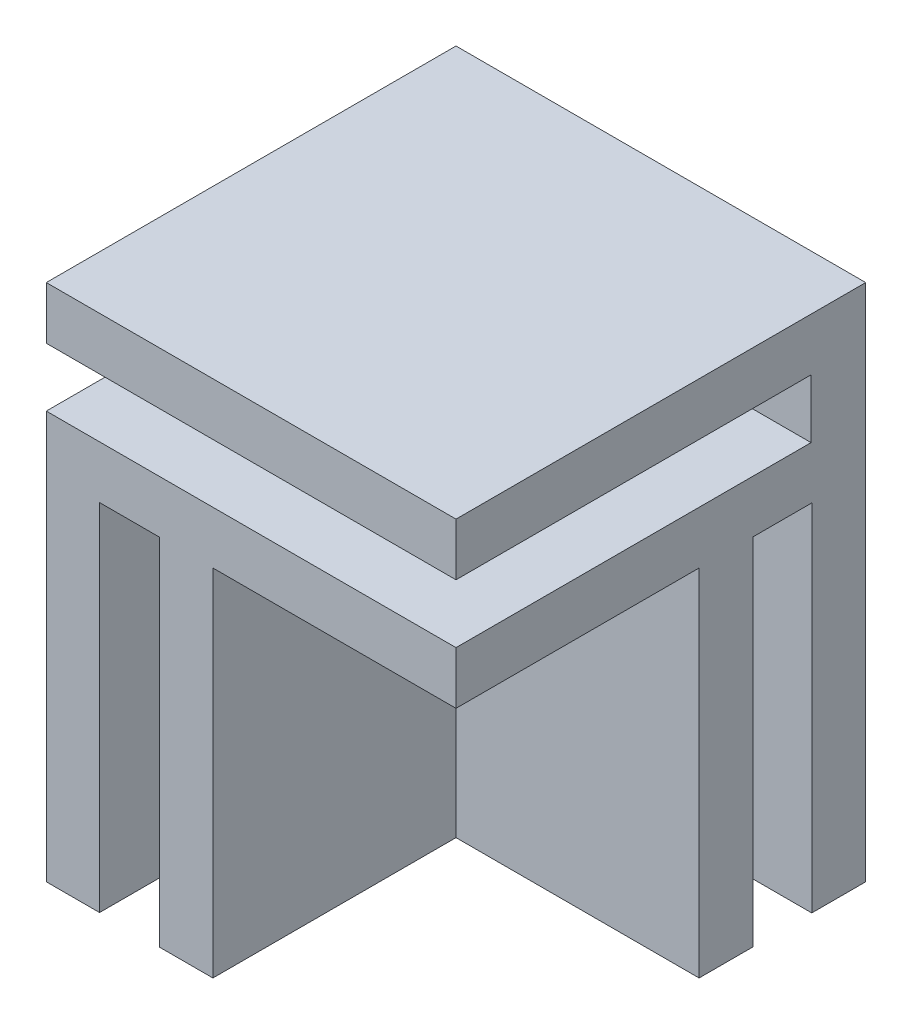
ISO-10303-21;
HEADER;
FILE_DESCRIPTION(('STEP AP214'),'2;1');
FILE_NAME('part.step','',(''),(''),'','','');
FILE_SCHEMA(('AUTOMOTIVE_DESIGN { 1 0 10303 214 1 1 1 1 }'));
ENDSEC;
DATA;
#1=APPLICATION_CONTEXT('core data for automotive mechanical design processes');
#2=APPLICATION_PROTOCOL_DEFINITION('international standard','automotive_design',2000,#1);
#3=PRODUCT_CONTEXT('',#1,'mechanical');
#4=PRODUCT('Part','Part','',(#3));
#5=PRODUCT_RELATED_PRODUCT_CATEGORY('part','',(#4));
#6=PRODUCT_DEFINITION_FORMATION('','',#4);
#7=PRODUCT_DEFINITION_CONTEXT('part definition',#1,'design');
#8=PRODUCT_DEFINITION('design','',#6,#7);
#9=PRODUCT_DEFINITION_SHAPE('','',#8);
#10=(LENGTH_UNIT() NAMED_UNIT(*) SI_UNIT(.MILLI.,.METRE.));
#11=(NAMED_UNIT(*) PLANE_ANGLE_UNIT() SI_UNIT($,.RADIAN.));
#12=(NAMED_UNIT(*) SI_UNIT($,.STERADIAN.) SOLID_ANGLE_UNIT());
#13=UNCERTAINTY_MEASURE_WITH_UNIT(LENGTH_MEASURE(1.E-05),#10,'distance_accuracy_value','');
#14=(GEOMETRIC_REPRESENTATION_CONTEXT(3) GLOBAL_UNCERTAINTY_ASSIGNED_CONTEXT((#13)) GLOBAL_UNIT_ASSIGNED_CONTEXT((#10,
#11,#12)) REPRESENTATION_CONTEXT('',''));
#15=CARTESIAN_POINT('',(0.,0.,0.));
#16=DIRECTION('',(0.,0.,1.));
#17=DIRECTION('',(1.,0.,0.));
#18=AXIS2_PLACEMENT_3D('',#15,#16,#17);
#19=CARTESIAN_POINT('',(-35.886738322403,38.,16.4685314685316));
#20=DIRECTION('',(0.,0.,-1.));
#21=DIRECTION('',(-1.,0.,0.));
#22=AXIS2_PLACEMENT_3D('',#19,#20,#21);
#23=PLANE('',#22);
#24=DIRECTION('',(0.,-1.,0.));
#25=VECTOR('',#24,1.);
#26=CARTESIAN_POINT('',(-5.88673832240304,38.,16.4685314685316));
#27=LINE('',#26,#25);
#28=CARTESIAN_POINT('',(-5.88673832240304,29.85,16.4685314685316));
#29=VERTEX_POINT('',#28);
#30=CARTESIAN_POINT('',(-5.88673832240304,26.,16.4685314685316));
#31=VERTEX_POINT('',#30);
#32=EDGE_CURVE('E196',#29,#31,#27,.T.);
#33=ORIENTED_EDGE('',*,*,#32,.F.);
#34=DIRECTION('',(-1.,0.,0.));
#35=VECTOR('',#34,1.);
#36=CARTESIAN_POINT('',(-5.88673832240304,29.85,16.4685314685316));
#37=LINE('',#36,#35);
#38=CARTESIAN_POINT('',(-35.886738322403,29.85,16.4685314685316));
#39=VERTEX_POINT('',#38);
#40=EDGE_CURVE('E255',#29,#39,#37,.T.);
#41=ORIENTED_EDGE('',*,*,#40,.T.);
#42=DIRECTION('',(0.,-1.,0.));
#43=VECTOR('',#42,1.);
#44=CARTESIAN_POINT('',(-35.886738322403,38.,16.4685314685316));
#45=LINE('',#44,#43);
#46=CARTESIAN_POINT('',(-35.886738322403,0.,16.4685314685316));
#47=VERTEX_POINT('',#46);
#48=EDGE_CURVE('E48',#39,#47,#45,.T.);
#49=ORIENTED_EDGE('',*,*,#48,.T.);
#50=DIRECTION('',(1.,0.,0.));
#51=VECTOR('',#50,1.);
#52=CARTESIAN_POINT('',(-35.886738322403,0.,16.4685314685316));
#53=LINE('',#52,#51);
#54=CARTESIAN_POINT('',(-31.986738322403,0.,16.4685314685316));
#55=VERTEX_POINT('',#54);
#56=EDGE_CURVE('E217',#47,#55,#53,.T.);
#57=ORIENTED_EDGE('',*,*,#56,.T.);
#58=DIRECTION('',(0.,-1.,0.));
#59=VECTOR('',#58,1.);
#60=CARTESIAN_POINT('',(-31.986738322403,26.,16.4685314685316));
#61=LINE('',#60,#59);
#62=CARTESIAN_POINT('',(-31.986738322403,26.,16.4685314685316));
#63=VERTEX_POINT('',#62);
#64=EDGE_CURVE('E274',#63,#55,#61,.T.);
#65=ORIENTED_EDGE('',*,*,#64,.F.);
#66=DIRECTION('',(-1.,0.,0.));
#67=VECTOR('',#66,1.);
#68=CARTESIAN_POINT('',(-27.586738322403,26.,16.4685314685316));
#69=LINE('',#68,#67);
#70=CARTESIAN_POINT('',(-27.586738322403,26.,16.4685314685316));
#71=VERTEX_POINT('',#70);
#72=EDGE_CURVE('E303',#71,#63,#69,.T.);
#73=ORIENTED_EDGE('',*,*,#72,.F.);
#74=DIRECTION('',(0.,-1.,0.));
#75=VECTOR('',#74,1.);
#76=CARTESIAN_POINT('',(-27.586738322403,26.,16.4685314685316));
#77=LINE('',#76,#75);
#78=CARTESIAN_POINT('',(-27.586738322403,0.,16.4685314685316));
#79=VERTEX_POINT('',#78);
#80=EDGE_CURVE('E270',#71,#79,#77,.T.);
#81=ORIENTED_EDGE('',*,*,#80,.T.);
#82=CARTESIAN_POINT('',(-23.686738322403,0.,16.4685314685316));
#83=VERTEX_POINT('',#82);
#84=EDGE_CURVE('E221',#79,#83,#53,.T.);
#85=ORIENTED_EDGE('',*,*,#84,.T.);
#86=DIRECTION('',(0.,-1.,0.));
#87=VECTOR('',#86,1.);
#88=CARTESIAN_POINT('',(-23.686738322403,26.,16.4685314685316));
#89=LINE('',#88,#87);
#90=CARTESIAN_POINT('',(-23.686738322403,26.,16.4685314685316));
#91=VERTEX_POINT('',#90);
#92=EDGE_CURVE('E63',#91,#83,#89,.T.);
#93=ORIENTED_EDGE('',*,*,#92,.F.);
#94=DIRECTION('',(-1.,0.,0.));
#95=VECTOR('',#94,1.);
#96=CARTESIAN_POINT('',(-5.88673832240304,26.,16.4685314685316));
#97=LINE('',#96,#95);
#98=EDGE_CURVE('E263',#31,#91,#97,.T.);
#99=ORIENTED_EDGE('',*,*,#98,.F.);
#100=EDGE_LOOP('',(#33,#41,#49,#57,#65,#73,#81,#85,#93,#99));
#101=FACE_BOUND('',#100,.T.);
#102=ADVANCED_FACE('F39',(#101),#23,.F.);
#103=CARTESIAN_POINT('',(-35.886738322403,38.,-13.5314685314684));
#104=DIRECTION('',(1.,0.,0.));
#105=DIRECTION('',(0.,0.,-1.));
#106=AXIS2_PLACEMENT_3D('',#103,#104,#105);
#107=PLANE('',#106);
#108=ORIENTED_EDGE('',*,*,#48,.F.);
#109=DIRECTION('',(0.,0.,1.));
#110=VECTOR('',#109,1.);
#111=CARTESIAN_POINT('',(-35.886738322403,29.85,16.4685314685316));
#112=LINE('',#111,#110);
#113=CARTESIAN_POINT('',(-35.886738322403,29.85,-9.53146853146841));
#114=VERTEX_POINT('',#113);
#115=EDGE_CURVE('E181',#114,#39,#112,.T.);
#116=ORIENTED_EDGE('',*,*,#115,.F.);
#117=DIRECTION('',(0.,-1.,0.));
#118=VECTOR('',#117,1.);
#119=CARTESIAN_POINT('',(-35.886738322403,34.15,-9.53146853146841));
#120=LINE('',#119,#118);
#121=CARTESIAN_POINT('',(-35.886738322403,34.15,-9.53146853146841));
#122=VERTEX_POINT('',#121);
#123=EDGE_CURVE('E358',#122,#114,#120,.T.);
#124=ORIENTED_EDGE('',*,*,#123,.F.);
#125=DIRECTION('',(0.,0.,-1.));
#126=VECTOR('',#125,1.);
#127=CARTESIAN_POINT('',(-35.886738322403,34.15,16.4685314685316));
#128=LINE('',#127,#126);
#129=CARTESIAN_POINT('',(-35.886738322403,34.15,16.4685314685316));
#130=VERTEX_POINT('',#129);
#131=EDGE_CURVE('E362',#130,#122,#128,.T.);
#132=ORIENTED_EDGE('',*,*,#131,.F.);
#133=CARTESIAN_POINT('',(-35.886738322403,38.,16.4685314685316));
#134=VERTEX_POINT('',#133);
#135=EDGE_CURVE('E11',#134,#130,#45,.T.);
#136=ORIENTED_EDGE('',*,*,#135,.F.);
#137=DIRECTION('',(0.,0.,1.));
#138=VECTOR('',#137,1.);
#139=CARTESIAN_POINT('',(-35.886738322403,38.,-13.5314685314684));
#140=LINE('',#139,#138);
#141=CARTESIAN_POINT('',(-35.886738322403,38.,-13.5314685314684));
#142=VERTEX_POINT('',#141);
#143=EDGE_CURVE('E212',#142,#134,#140,.T.);
#144=ORIENTED_EDGE('',*,*,#143,.F.);
#145=DIRECTION('',(0.,-1.,0.));
#146=VECTOR('',#145,1.);
#147=CARTESIAN_POINT('',(-35.886738322403,38.,-13.5314685314684));
#148=LINE('',#147,#146);
#149=CARTESIAN_POINT('',(-35.886738322403,0.,-13.5314685314684));
#150=VERTEX_POINT('',#149);
#151=EDGE_CURVE('E204',#142,#150,#148,.T.);
#152=ORIENTED_EDGE('',*,*,#151,.T.);
#153=DIRECTION('',(0.,0.,1.));
#154=VECTOR('',#153,1.);
#155=CARTESIAN_POINT('',(-35.886738322403,0.,-13.5314685314684));
#156=LINE('',#155,#154);
#157=EDGE_CURVE('E222',#150,#47,#156,.T.);
#158=ORIENTED_EDGE('',*,*,#157,.T.);
#159=EDGE_LOOP('',(#108,#116,#124,#132,#136,#144,#152,#158));
#160=FACE_BOUND('',#159,.T.);
#161=ADVANCED_FACE('F41',(#160),#107,.F.);
#162=ORIENTED_EDGE('',*,*,#135,.T.);
#163=DIRECTION('',(-1.,0.,0.));
#164=VECTOR('',#163,1.);
#165=CARTESIAN_POINT('',(-5.88673832240304,34.15,16.4685314685316));
#166=LINE('',#165,#164);
#167=CARTESIAN_POINT('',(-5.88673832240304,34.15,16.4685314685316));
#168=VERTEX_POINT('',#167);
#169=EDGE_CURVE('E175',#168,#130,#166,.T.);
#170=ORIENTED_EDGE('',*,*,#169,.F.);
#171=CARTESIAN_POINT('',(-5.88673832240304,38.,16.4685314685316));
#172=VERTEX_POINT('',#171);
#173=EDGE_CURVE('E186',#172,#168,#27,.T.);
#174=ORIENTED_EDGE('',*,*,#173,.F.);
#175=DIRECTION('',(1.,0.,0.));
#176=VECTOR('',#175,1.);
#177=CARTESIAN_POINT('',(-35.886738322403,38.,16.4685314685316));
#178=LINE('',#177,#176);
#179=EDGE_CURVE('E231',#134,#172,#178,.T.);
#180=ORIENTED_EDGE('',*,*,#179,.F.);
#181=EDGE_LOOP('',(#162,#170,#174,#180));
#182=FACE_BOUND('',#181,.T.);
#183=ADVANCED_FACE('F185',(#182),#23,.F.);
#184=CARTESIAN_POINT('',(-5.88673832240304,38.,-13.5314685314684));
#185=DIRECTION('',(-1.,0.,0.));
#186=DIRECTION('',(0.,0.,1.));
#187=AXIS2_PLACEMENT_3D('',#184,#185,#186);
#188=PLANE('',#187);
#189=DIRECTION('',(0.,-1.,0.));
#190=VECTOR('',#189,1.);
#191=CARTESIAN_POINT('',(-5.88673832240304,34.15,-9.53146853146841));
#192=LINE('',#191,#190);
#193=CARTESIAN_POINT('',(-5.88673832240304,34.15,-9.53146853146841));
#194=VERTEX_POINT('',#193);
#195=CARTESIAN_POINT('',(-5.88673832240304,29.85,-9.53146853146841));
#196=VERTEX_POINT('',#195);
#197=EDGE_CURVE('E55',#194,#196,#192,.T.);
#198=ORIENTED_EDGE('',*,*,#197,.T.);
#199=DIRECTION('',(0.,0.,1.));
#200=VECTOR('',#199,1.);
#201=CARTESIAN_POINT('',(-5.88673832240304,29.85,16.4685314685316));
#202=LINE('',#201,#200);
#203=EDGE_CURVE('E190',#196,#29,#202,.T.);
#204=ORIENTED_EDGE('',*,*,#203,.T.);
#205=ORIENTED_EDGE('',*,*,#32,.T.);
#206=DIRECTION('',(0.,0.,1.));
#207=VECTOR('',#206,1.);
#208=CARTESIAN_POINT('',(-5.88673832240304,26.,16.4685314685316));
#209=LINE('',#208,#207);
#210=CARTESIAN_POINT('',(-5.88673832240304,26.,-1.33146853146841));
#211=VERTEX_POINT('',#210);
#212=EDGE_CURVE('E251',#211,#31,#209,.T.);
#213=ORIENTED_EDGE('',*,*,#212,.F.);
#214=DIRECTION('',(0.,-1.,0.));
#215=VECTOR('',#214,1.);
#216=CARTESIAN_POINT('',(-5.88673832240304,26.,-1.33146853146841));
#217=LINE('',#216,#215);
#218=CARTESIAN_POINT('',(-5.88673832240304,0.,-1.33146853146841));
#219=VERTEX_POINT('',#218);
#220=EDGE_CURVE('E243',#211,#219,#217,.T.);
#221=ORIENTED_EDGE('',*,*,#220,.T.);
#222=DIRECTION('',(0.,0.,-1.));
#223=VECTOR('',#222,1.);
#224=CARTESIAN_POINT('',(-5.88673832240304,0.,-13.5314685314684));
#225=LINE('',#224,#223);
#226=CARTESIAN_POINT('',(-5.88673832240304,0.,-5.28146853146841));
#227=VERTEX_POINT('',#226);
#228=EDGE_CURVE('E213',#219,#227,#225,.T.);
#229=ORIENTED_EDGE('',*,*,#228,.T.);
#230=DIRECTION('',(0.,-1.,0.));
#231=VECTOR('',#230,1.);
#232=CARTESIAN_POINT('',(-5.88673832240304,26.,-5.28146853146841));
#233=LINE('',#232,#231);
#234=CARTESIAN_POINT('',(-5.88673832240304,26.,-5.28146853146841));
#235=VERTEX_POINT('',#234);
#236=EDGE_CURVE('E310',#235,#227,#233,.T.);
#237=ORIENTED_EDGE('',*,*,#236,.F.);
#238=DIRECTION('',(0.,0.,1.));
#239=VECTOR('',#238,1.);
#240=CARTESIAN_POINT('',(-5.88673832240304,26.,-9.58146853146841));
#241=LINE('',#240,#239);
#242=CARTESIAN_POINT('',(-5.88673832240304,26.,-9.58146853146841));
#243=VERTEX_POINT('',#242);
#244=EDGE_CURVE('E326',#243,#235,#241,.T.);
#245=ORIENTED_EDGE('',*,*,#244,.F.);
#246=DIRECTION('',(0.,-1.,0.));
#247=VECTOR('',#246,1.);
#248=CARTESIAN_POINT('',(-5.88673832240304,26.,-9.58146853146841));
#249=LINE('',#248,#247);
#250=CARTESIAN_POINT('',(-5.88673832240304,0.,-9.58146853146841));
#251=VERTEX_POINT('',#250);
#252=EDGE_CURVE('E226',#243,#251,#249,.T.);
#253=ORIENTED_EDGE('',*,*,#252,.T.);
#254=CARTESIAN_POINT('',(-5.88673832240304,0.,-13.5314685314684));
#255=VERTEX_POINT('',#254);
#256=EDGE_CURVE('E214',#251,#255,#225,.T.);
#257=ORIENTED_EDGE('',*,*,#256,.T.);
#258=DIRECTION('',(0.,-1.,0.));
#259=VECTOR('',#258,1.);
#260=CARTESIAN_POINT('',(-5.88673832240304,38.,-13.5314685314684));
#261=LINE('',#260,#259);
#262=CARTESIAN_POINT('',(-5.88673832240304,38.,-13.5314685314684));
#263=VERTEX_POINT('',#262);
#264=EDGE_CURVE('E199',#263,#255,#261,.T.);
#265=ORIENTED_EDGE('',*,*,#264,.F.);
#266=DIRECTION('',(0.,0.,-1.));
#267=VECTOR('',#266,1.);
#268=CARTESIAN_POINT('',(-5.88673832240304,38.,-13.5314685314684));
#269=LINE('',#268,#267);
#270=EDGE_CURVE('E194',#172,#263,#269,.T.);
#271=ORIENTED_EDGE('',*,*,#270,.F.);
#272=ORIENTED_EDGE('',*,*,#173,.T.);
#273=DIRECTION('',(0.,0.,-1.));
#274=VECTOR('',#273,1.);
#275=CARTESIAN_POINT('',(-5.88673832240304,34.15,16.4685314685316));
#276=LINE('',#275,#274);
#277=EDGE_CURVE('E171',#168,#194,#276,.T.);
#278=ORIENTED_EDGE('',*,*,#277,.T.);
#279=EDGE_LOOP('',(#198,#204,#205,#213,#221,#229,#237,#245,#253,#257,#265,#271,#272,#278));
#280=FACE_BOUND('',#279,.T.);
#281=ADVANCED_FACE('F192',(#280),#188,.F.);
#282=CARTESIAN_POINT('',(-35.886738322403,38.,-13.5314685314684));
#283=DIRECTION('',(0.,0.,1.));
#284=DIRECTION('',(1.,0.,0.));
#285=AXIS2_PLACEMENT_3D('',#282,#283,#284);
#286=PLANE('',#285);
#287=DIRECTION('',(-1.,0.,0.));
#288=VECTOR('',#287,1.);
#289=CARTESIAN_POINT('',(-35.886738322403,0.,-13.5314685314684));
#290=LINE('',#289,#288);
#291=EDGE_CURVE('E209',#255,#150,#290,.T.);
#292=ORIENTED_EDGE('',*,*,#291,.T.);
#293=ORIENTED_EDGE('',*,*,#151,.F.);
#294=DIRECTION('',(-1.,0.,0.));
#295=VECTOR('',#294,1.);
#296=CARTESIAN_POINT('',(-35.886738322403,38.,-13.5314685314684));
#297=LINE('',#296,#295);
#298=EDGE_CURVE('E208',#263,#142,#297,.T.);
#299=ORIENTED_EDGE('',*,*,#298,.F.);
#300=ORIENTED_EDGE('',*,*,#264,.T.);
#301=EDGE_LOOP('',(#292,#293,#299,#300));
#302=FACE_BOUND('',#301,.T.);
#303=ADVANCED_FACE('F418',(#302),#286,.F.);
#304=CARTESIAN_POINT('',(0.,38.,0.));
#305=DIRECTION('',(0.,1.,0.));
#306=DIRECTION('',(0.,0.,1.));
#307=AXIS2_PLACEMENT_3D('',#304,#305,#306);
#308=PLANE('',#307);
#309=ORIENTED_EDGE('',*,*,#143,.T.);
#310=ORIENTED_EDGE('',*,*,#179,.T.);
#311=ORIENTED_EDGE('',*,*,#270,.T.);
#312=ORIENTED_EDGE('',*,*,#298,.T.);
#313=EDGE_LOOP('',(#309,#310,#311,#312));
#314=FACE_BOUND('',#313,.T.);
#315=ADVANCED_FACE('F405',(#314),#308,.T.);
#316=CARTESIAN_POINT('',(0.,0.,0.));
#317=DIRECTION('',(0.,1.,0.));
#318=DIRECTION('',(0.,0.,1.));
#319=AXIS2_PLACEMENT_3D('',#316,#317,#318);
#320=PLANE('',#319);
#321=ORIENTED_EDGE('',*,*,#256,.F.);
#322=DIRECTION('',(1.,0.,0.));
#323=VECTOR('',#322,1.);
#324=CARTESIAN_POINT('',(-5.88673832240304,0.,-9.58146853146841));
#325=LINE('',#324,#323);
#326=CARTESIAN_POINT('',(-23.686738322403,0.,-9.58146853146841));
#327=VERTEX_POINT('',#326);
#328=EDGE_CURVE('E323',#327,#251,#325,.T.);
#329=ORIENTED_EDGE('',*,*,#328,.F.);
#330=DIRECTION('',(0.,0.,-1.));
#331=VECTOR('',#330,1.);
#332=CARTESIAN_POINT('',(-23.686738322403,0.,-9.58146853146841));
#333=LINE('',#332,#331);
#334=CARTESIAN_POINT('',(-23.686738322403,0.,-5.28146853146841));
#335=VERTEX_POINT('',#334);
#336=EDGE_CURVE('E327',#335,#327,#333,.T.);
#337=ORIENTED_EDGE('',*,*,#336,.F.);
#338=DIRECTION('',(-1.,0.,0.));
#339=VECTOR('',#338,1.);
#340=CARTESIAN_POINT('',(-5.88673832240304,0.,-5.28146853146841));
#341=LINE('',#340,#339);
#342=EDGE_CURVE('E284',#227,#335,#341,.T.);
#343=ORIENTED_EDGE('',*,*,#342,.F.);
#344=ORIENTED_EDGE('',*,*,#228,.F.);
#345=DIRECTION('',(1.,0.,0.));
#346=VECTOR('',#345,1.);
#347=CARTESIAN_POINT('',(-5.88673832240304,0.,-1.33146853146841));
#348=LINE('',#347,#346);
#349=CARTESIAN_POINT('',(-23.686738322403,0.,-1.33146853146841));
#350=VERTEX_POINT('',#349);
#351=EDGE_CURVE('E248',#350,#219,#348,.T.);
#352=ORIENTED_EDGE('',*,*,#351,.F.);
#353=DIRECTION('',(0.,0.,-1.));
#354=VECTOR('',#353,1.);
#355=CARTESIAN_POINT('',(-23.686738322403,0.,16.4685314685316));
#356=LINE('',#355,#354);
#357=EDGE_CURVE('E252',#83,#350,#356,.T.);
#358=ORIENTED_EDGE('',*,*,#357,.F.);
#359=ORIENTED_EDGE('',*,*,#84,.F.);
#360=DIRECTION('',(0.,0.,1.));
#361=VECTOR('',#360,1.);
#362=CARTESIAN_POINT('',(-27.586738322403,0.,16.4685314685316));
#363=LINE('',#362,#361);
#364=CARTESIAN_POINT('',(-27.586738322403,0.,-1.33146853146841));
#365=VERTEX_POINT('',#364);
#366=EDGE_CURVE('E247',#365,#79,#363,.T.);
#367=ORIENTED_EDGE('',*,*,#366,.F.);
#368=DIRECTION('',(1.,0.,0.));
#369=VECTOR('',#368,1.);
#370=CARTESIAN_POINT('',(-27.586738322403,0.,-1.33146853146841));
#371=LINE('',#370,#369);
#372=CARTESIAN_POINT('',(-31.986738322403,0.,-1.33146853146841));
#373=VERTEX_POINT('',#372);
#374=EDGE_CURVE('E285',#373,#365,#371,.T.);
#375=ORIENTED_EDGE('',*,*,#374,.F.);
#376=DIRECTION('',(0.,0.,-1.));
#377=VECTOR('',#376,1.);
#378=CARTESIAN_POINT('',(-31.986738322403,0.,16.4685314685316));
#379=LINE('',#378,#377);
#380=EDGE_CURVE('E290',#55,#373,#379,.T.);
#381=ORIENTED_EDGE('',*,*,#380,.F.);
#382=ORIENTED_EDGE('',*,*,#56,.F.);
#383=ORIENTED_EDGE('',*,*,#157,.F.);
#384=ORIENTED_EDGE('',*,*,#291,.F.);
#385=EDGE_LOOP('',(#321,#329,#337,#343,#344,#352,#358,#359,#367,#375,#381,#382,#383,#384));
#386=FACE_BOUND('',#385,.T.);
#387=ADVANCED_FACE('F388',(#386),#320,.F.);
#388=CARTESIAN_POINT('',(-5.88673832240304,26.,-1.33146853146841));
#389=DIRECTION('',(0.,0.,-1.));
#390=DIRECTION('',(-1.,0.,0.));
#391=AXIS2_PLACEMENT_3D('',#388,#389,#390);
#392=PLANE('',#391);
#393=ORIENTED_EDGE('',*,*,#351,.T.);
#394=ORIENTED_EDGE('',*,*,#220,.F.);
#395=DIRECTION('',(1.,0.,0.));
#396=VECTOR('',#395,1.);
#397=CARTESIAN_POINT('',(-5.88673832240304,26.,-1.33146853146841));
#398=LINE('',#397,#396);
#399=CARTESIAN_POINT('',(-23.686738322403,26.,-1.33146853146841));
#400=VERTEX_POINT('',#399);
#401=EDGE_CURVE('E240',#400,#211,#398,.T.);
#402=ORIENTED_EDGE('',*,*,#401,.F.);
#403=DIRECTION('',(0.,-1.,0.));
#404=VECTOR('',#403,1.);
#405=CARTESIAN_POINT('',(-23.686738322403,26.,-1.33146853146841));
#406=LINE('',#405,#404);
#407=EDGE_CURVE('E239',#400,#350,#406,.T.);
#408=ORIENTED_EDGE('',*,*,#407,.T.);
#409=EDGE_LOOP('',(#393,#394,#402,#408));
#410=FACE_BOUND('',#409,.T.);
#411=ADVANCED_FACE('F397',(#410),#392,.F.);
#412=CARTESIAN_POINT('',(-23.686738322403,26.,16.4685314685316));
#413=DIRECTION('',(-1.,0.,0.));
#414=DIRECTION('',(0.,0.,1.));
#415=AXIS2_PLACEMENT_3D('',#412,#413,#414);
#416=PLANE('',#415);
#417=ORIENTED_EDGE('',*,*,#357,.T.);
#418=ORIENTED_EDGE('',*,*,#407,.F.);
#419=DIRECTION('',(0.,0.,-1.));
#420=VECTOR('',#419,1.);
#421=CARTESIAN_POINT('',(-23.686738322403,26.,16.4685314685316));
#422=LINE('',#421,#420);
#423=EDGE_CURVE('E259',#91,#400,#422,.T.);
#424=ORIENTED_EDGE('',*,*,#423,.F.);
#425=ORIENTED_EDGE('',*,*,#92,.T.);
#426=EDGE_LOOP('',(#417,#418,#424,#425));
#427=FACE_BOUND('',#426,.T.);
#428=ADVANCED_FACE('F396',(#427),#416,.F.);
#429=CARTESIAN_POINT('',(0.,26.,0.));
#430=DIRECTION('',(0.,1.,0.));
#431=DIRECTION('',(0.,0.,1.));
#432=AXIS2_PLACEMENT_3D('',#429,#430,#431);
#433=PLANE('',#432);
#434=ORIENTED_EDGE('',*,*,#212,.T.);
#435=ORIENTED_EDGE('',*,*,#98,.T.);
#436=ORIENTED_EDGE('',*,*,#423,.T.);
#437=ORIENTED_EDGE('',*,*,#401,.T.);
#438=EDGE_LOOP('',(#434,#435,#436,#437));
#439=FACE_BOUND('',#438,.T.);
#440=ADVANCED_FACE('F378',(#439),#433,.F.);
#441=CARTESIAN_POINT('',(-27.586738322403,26.,16.4685314685316));
#442=DIRECTION('',(1.,0.,0.));
#443=DIRECTION('',(0.,0.,-1.));
#444=AXIS2_PLACEMENT_3D('',#441,#442,#443);
#445=PLANE('',#444);
#446=ORIENTED_EDGE('',*,*,#366,.T.);
#447=ORIENTED_EDGE('',*,*,#80,.F.);
#448=DIRECTION('',(0.,0.,1.));
#449=VECTOR('',#448,1.);
#450=CARTESIAN_POINT('',(-27.586738322403,26.,16.4685314685316));
#451=LINE('',#450,#449);
#452=CARTESIAN_POINT('',(-27.586738322403,26.,-1.33146853146841));
#453=VERTEX_POINT('',#452);
#454=EDGE_CURVE('E289',#453,#71,#451,.T.);
#455=ORIENTED_EDGE('',*,*,#454,.F.);
#456=DIRECTION('',(0.,-1.,0.));
#457=VECTOR('',#456,1.);
#458=CARTESIAN_POINT('',(-27.586738322403,26.,-1.33146853146841));
#459=LINE('',#458,#457);
#460=EDGE_CURVE('E281',#453,#365,#459,.T.);
#461=ORIENTED_EDGE('',*,*,#460,.T.);
#462=EDGE_LOOP('',(#446,#447,#455,#461));
#463=FACE_BOUND('',#462,.T.);
#464=ADVANCED_FACE('F469',(#463),#445,.F.);
#465=CARTESIAN_POINT('',(-27.586738322403,26.,-1.33146853146841));
#466=DIRECTION('',(0.,0.,-1.));
#467=DIRECTION('',(-1.,0.,0.));
#468=AXIS2_PLACEMENT_3D('',#465,#466,#467);
#469=PLANE('',#468);
#470=ORIENTED_EDGE('',*,*,#374,.T.);
#471=ORIENTED_EDGE('',*,*,#460,.F.);
#472=DIRECTION('',(1.,0.,0.));
#473=VECTOR('',#472,1.);
#474=CARTESIAN_POINT('',(-27.586738322403,26.,-1.33146853146841));
#475=LINE('',#474,#473);
#476=CARTESIAN_POINT('',(-31.986738322403,26.,-1.33146853146841));
#477=VERTEX_POINT('',#476);
#478=EDGE_CURVE('E275',#477,#453,#475,.T.);
#479=ORIENTED_EDGE('',*,*,#478,.F.);
#480=DIRECTION('',(0.,-1.,0.));
#481=VECTOR('',#480,1.);
#482=CARTESIAN_POINT('',(-31.986738322403,26.,-1.33146853146841));
#483=LINE('',#482,#481);
#484=EDGE_CURVE('E278',#477,#373,#483,.T.);
#485=ORIENTED_EDGE('',*,*,#484,.T.);
#486=EDGE_LOOP('',(#470,#471,#479,#485));
#487=FACE_BOUND('',#486,.T.);
#488=ADVANCED_FACE('F466',(#487),#469,.F.);
#489=CARTESIAN_POINT('',(-31.986738322403,26.,16.4685314685316));
#490=DIRECTION('',(-1.,0.,0.));
#491=DIRECTION('',(0.,0.,1.));
#492=AXIS2_PLACEMENT_3D('',#489,#490,#491);
#493=PLANE('',#492);
#494=ORIENTED_EDGE('',*,*,#380,.T.);
#495=ORIENTED_EDGE('',*,*,#484,.F.);
#496=DIRECTION('',(0.,0.,-1.));
#497=VECTOR('',#496,1.);
#498=CARTESIAN_POINT('',(-31.986738322403,26.,16.4685314685316));
#499=LINE('',#498,#497);
#500=EDGE_CURVE('E299',#63,#477,#499,.T.);
#501=ORIENTED_EDGE('',*,*,#500,.F.);
#502=ORIENTED_EDGE('',*,*,#64,.T.);
#503=EDGE_LOOP('',(#494,#495,#501,#502));
#504=FACE_BOUND('',#503,.T.);
#505=ADVANCED_FACE('F464',(#504),#493,.F.);
#506=CARTESIAN_POINT('',(0.,26.,0.));
#507=DIRECTION('',(0.,1.,0.));
#508=DIRECTION('',(0.,0.,1.));
#509=AXIS2_PLACEMENT_3D('',#506,#507,#508);
#510=PLANE('',#509);
#511=ORIENTED_EDGE('',*,*,#454,.T.);
#512=ORIENTED_EDGE('',*,*,#72,.T.);
#513=ORIENTED_EDGE('',*,*,#500,.T.);
#514=ORIENTED_EDGE('',*,*,#478,.T.);
#515=EDGE_LOOP('',(#511,#512,#513,#514));
#516=FACE_BOUND('',#515,.T.);
#517=ADVANCED_FACE('F454',(#516),#510,.F.);
#518=CARTESIAN_POINT('',(-5.88673832240304,26.,-9.58146853146841));
#519=DIRECTION('',(0.,0.,-1.));
#520=DIRECTION('',(-1.,0.,0.));
#521=AXIS2_PLACEMENT_3D('',#518,#519,#520);
#522=PLANE('',#521);
#523=ORIENTED_EDGE('',*,*,#328,.T.);
#524=ORIENTED_EDGE('',*,*,#252,.F.);
#525=DIRECTION('',(1.,0.,0.));
#526=VECTOR('',#525,1.);
#527=CARTESIAN_POINT('',(-5.88673832240304,26.,-9.58146853146841));
#528=LINE('',#527,#526);
#529=CARTESIAN_POINT('',(-23.686738322403,26.,-9.58146853146841));
#530=VERTEX_POINT('',#529);
#531=EDGE_CURVE('E314',#530,#243,#528,.T.);
#532=ORIENTED_EDGE('',*,*,#531,.F.);
#533=DIRECTION('',(0.,-1.,0.));
#534=VECTOR('',#533,1.);
#535=CARTESIAN_POINT('',(-23.686738322403,26.,-9.58146853146841));
#536=LINE('',#535,#534);
#537=EDGE_CURVE('E317',#530,#327,#536,.T.);
#538=ORIENTED_EDGE('',*,*,#537,.T.);
#539=EDGE_LOOP('',(#523,#524,#532,#538));
#540=FACE_BOUND('',#539,.T.);
#541=ADVANCED_FACE('F450',(#540),#522,.F.);
#542=CARTESIAN_POINT('',(-23.686738322403,26.,-9.58146853146841));
#543=DIRECTION('',(-1.,0.,0.));
#544=DIRECTION('',(0.,0.,1.));
#545=AXIS2_PLACEMENT_3D('',#542,#543,#544);
#546=PLANE('',#545);
#547=ORIENTED_EDGE('',*,*,#336,.T.);
#548=ORIENTED_EDGE('',*,*,#537,.F.);
#549=DIRECTION('',(0.,0.,-1.));
#550=VECTOR('',#549,1.);
#551=CARTESIAN_POINT('',(-23.686738322403,26.,-9.58146853146841));
#552=LINE('',#551,#550);
#553=CARTESIAN_POINT('',(-23.686738322403,26.,-5.28146853146841));
#554=VERTEX_POINT('',#553);
#555=EDGE_CURVE('E337',#554,#530,#552,.T.);
#556=ORIENTED_EDGE('',*,*,#555,.F.);
#557=DIRECTION('',(0.,-1.,0.));
#558=VECTOR('',#557,1.);
#559=CARTESIAN_POINT('',(-23.686738322403,26.,-5.28146853146841));
#560=LINE('',#559,#558);
#561=EDGE_CURVE('E313',#554,#335,#560,.T.);
#562=ORIENTED_EDGE('',*,*,#561,.T.);
#563=EDGE_LOOP('',(#547,#548,#556,#562));
#564=FACE_BOUND('',#563,.T.);
#565=ADVANCED_FACE('F453',(#564),#546,.F.);
#566=CARTESIAN_POINT('',(-5.88673832240304,26.,-5.28146853146841));
#567=DIRECTION('',(0.,0.,1.));
#568=DIRECTION('',(1.,0.,0.));
#569=AXIS2_PLACEMENT_3D('',#566,#567,#568);
#570=PLANE('',#569);
#571=ORIENTED_EDGE('',*,*,#342,.T.);
#572=ORIENTED_EDGE('',*,*,#561,.F.);
#573=DIRECTION('',(-1.,0.,0.));
#574=VECTOR('',#573,1.);
#575=CARTESIAN_POINT('',(-5.88673832240304,26.,-5.28146853146841));
#576=LINE('',#575,#574);
#577=EDGE_CURVE('E341',#235,#554,#576,.T.);
#578=ORIENTED_EDGE('',*,*,#577,.F.);
#579=ORIENTED_EDGE('',*,*,#236,.T.);
#580=EDGE_LOOP('',(#571,#572,#578,#579));
#581=FACE_BOUND('',#580,.T.);
#582=ADVANCED_FACE('F444',(#581),#570,.F.);
#583=CARTESIAN_POINT('',(0.,26.,0.));
#584=DIRECTION('',(0.,-1.,0.));
#585=DIRECTION('',(0.,0.,-1.));
#586=AXIS2_PLACEMENT_3D('',#583,#584,#585);
#587=PLANE('',#586);
#588=ORIENTED_EDGE('',*,*,#244,.T.);
#589=ORIENTED_EDGE('',*,*,#577,.T.);
#590=ORIENTED_EDGE('',*,*,#555,.T.);
#591=ORIENTED_EDGE('',*,*,#531,.T.);
#592=EDGE_LOOP('',(#588,#589,#590,#591));
#593=FACE_BOUND('',#592,.T.);
#594=ADVANCED_FACE('F437',(#593),#587,.T.);
#595=CARTESIAN_POINT('',(-5.88673832240304,29.85,16.4685314685316));
#596=DIRECTION('',(0.,-1.,0.));
#597=DIRECTION('',(0.,0.,-1.));
#598=AXIS2_PLACEMENT_3D('',#595,#596,#597);
#599=PLANE('',#598);
#600=ORIENTED_EDGE('',*,*,#115,.T.);
#601=ORIENTED_EDGE('',*,*,#40,.F.);
#602=ORIENTED_EDGE('',*,*,#203,.F.);
#603=DIRECTION('',(-1.,0.,0.));
#604=VECTOR('',#603,1.);
#605=CARTESIAN_POINT('',(-5.88673832240304,29.85,-9.53146853146841));
#606=LINE('',#605,#604);
#607=EDGE_CURVE('E350',#196,#114,#606,.T.);
#608=ORIENTED_EDGE('',*,*,#607,.T.);
#609=EDGE_LOOP('',(#600,#601,#602,#608));
#610=FACE_BOUND('',#609,.T.);
#611=ADVANCED_FACE('F435',(#610),#599,.F.);
#612=CARTESIAN_POINT('',(-5.88673832240304,34.15,-9.53146853146841));
#613=DIRECTION('',(0.,0.,-1.));
#614=DIRECTION('',(-1.,0.,0.));
#615=AXIS2_PLACEMENT_3D('',#612,#613,#614);
#616=PLANE('',#615);
#617=ORIENTED_EDGE('',*,*,#123,.T.);
#618=ORIENTED_EDGE('',*,*,#607,.F.);
#619=ORIENTED_EDGE('',*,*,#197,.F.);
#620=DIRECTION('',(-1.,0.,0.));
#621=VECTOR('',#620,1.);
#622=CARTESIAN_POINT('',(-5.88673832240304,34.15,-9.53146853146841));
#623=LINE('',#622,#621);
#624=EDGE_CURVE('E177',#194,#122,#623,.T.);
#625=ORIENTED_EDGE('',*,*,#624,.T.);
#626=EDGE_LOOP('',(#617,#618,#619,#625));
#627=FACE_BOUND('',#626,.T.);
#628=ADVANCED_FACE('F434',(#627),#616,.F.);
#629=CARTESIAN_POINT('',(-5.88673832240304,34.15,16.4685314685316));
#630=DIRECTION('',(0.,1.,0.));
#631=DIRECTION('',(0.,0.,1.));
#632=AXIS2_PLACEMENT_3D('',#629,#630,#631);
#633=PLANE('',#632);
#634=ORIENTED_EDGE('',*,*,#131,.T.);
#635=ORIENTED_EDGE('',*,*,#624,.F.);
#636=ORIENTED_EDGE('',*,*,#277,.F.);
#637=ORIENTED_EDGE('',*,*,#169,.T.);
#638=EDGE_LOOP('',(#634,#635,#636,#637));
#639=FACE_BOUND('',#638,.T.);
#640=ADVANCED_FACE('F174',(#639),#633,.F.);
#641=CLOSED_SHELL('',(#102,#161,#183,#281,#303,#315,#387,#411,#428,#440,#464,#488,#505,#517,
#541,#565,#582,#594,#611,#628,#640));
#642=MANIFOLD_SOLID_BREP('B2',#641);
#643=ADVANCED_BREP_SHAPE_REPRESENTATION('',(#18,#642),#14);
#644=SHAPE_DEFINITION_REPRESENTATION(#9,#643);
ENDSEC;
END-ISO-10303-21;
